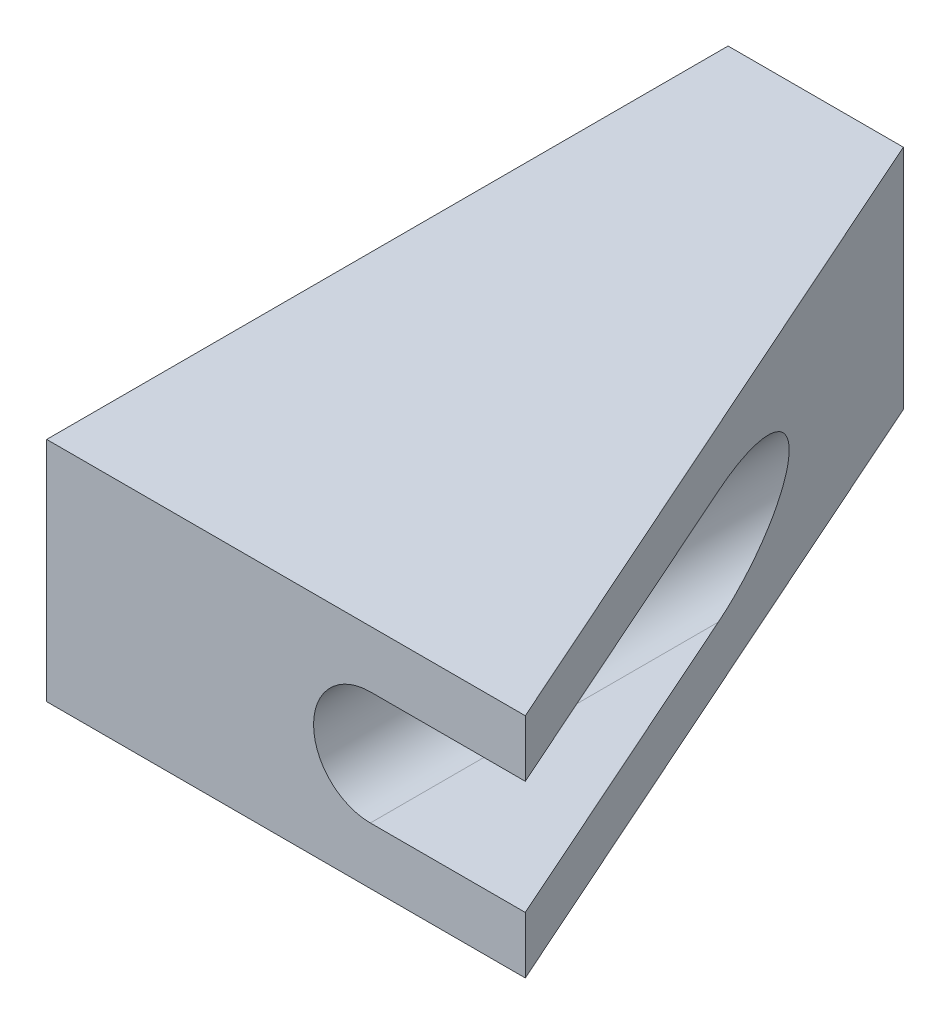
ISO-10303-21;
HEADER;
FILE_DESCRIPTION(('STEP AP214'),'2;1');
FILE_NAME('part.step','',(''),(''),'','','');
FILE_SCHEMA(('AUTOMOTIVE_DESIGN { 1 0 10303 214 1 1 1 1 }'));
ENDSEC;
DATA;
#1=APPLICATION_CONTEXT('core data for automotive mechanical design processes');
#2=APPLICATION_PROTOCOL_DEFINITION('international standard','automotive_design',2000,#1);
#3=PRODUCT_CONTEXT('',#1,'mechanical');
#4=PRODUCT('Part','Part','',(#3));
#5=PRODUCT_RELATED_PRODUCT_CATEGORY('part','',(#4));
#6=PRODUCT_DEFINITION_FORMATION('','',#4);
#7=PRODUCT_DEFINITION_CONTEXT('part definition',#1,'design');
#8=PRODUCT_DEFINITION('design','',#6,#7);
#9=PRODUCT_DEFINITION_SHAPE('','',#8);
#10=(LENGTH_UNIT() NAMED_UNIT(*) SI_UNIT(.MILLI.,.METRE.));
#11=(NAMED_UNIT(*) PLANE_ANGLE_UNIT() SI_UNIT($,.RADIAN.));
#12=(NAMED_UNIT(*) SI_UNIT($,.STERADIAN.) SOLID_ANGLE_UNIT());
#13=UNCERTAINTY_MEASURE_WITH_UNIT(LENGTH_MEASURE(1.E-05),#10,'distance_accuracy_value','');
#14=(GEOMETRIC_REPRESENTATION_CONTEXT(3) GLOBAL_UNCERTAINTY_ASSIGNED_CONTEXT((#13)) GLOBAL_UNIT_ASSIGNED_CONTEXT((#10,
#11,#12)) REPRESENTATION_CONTEXT('',''));
#15=CARTESIAN_POINT('',(0.,0.,0.));
#16=DIRECTION('',(0.,0.,1.));
#17=DIRECTION('',(1.,0.,0.));
#18=AXIS2_PLACEMENT_3D('',#15,#16,#17);
#19=CARTESIAN_POINT('',(8.42869934449654,4.,0.));
#20=DIRECTION('',(0.,0.,-1.));
#21=DIRECTION('',(-1.,0.,0.));
#22=AXIS2_PLACEMENT_3D('',#19,#20,#21);
#23=PLANE('',#22);
#24=DIRECTION('',(1.,0.,0.));
#25=VECTOR('',#24,1.);
#26=CARTESIAN_POINT('',(4.21434967224827,3.,0.));
#27=LINE('',#26,#25);
#28=CARTESIAN_POINT('',(5.7,3.,0.));
#29=VERTEX_POINT('',#28);
#30=CARTESIAN_POINT('',(8.42869934449654,3.,0.));
#31=VERTEX_POINT('',#30);
#32=EDGE_CURVE('E52',#29,#31,#27,.T.);
#33=ORIENTED_EDGE('',*,*,#32,.T.);
#34=DIRECTION('',(0.,-1.,0.));
#35=VECTOR('',#34,1.);
#36=CARTESIAN_POINT('',(8.42869934449654,4.,0.));
#37=LINE('',#36,#35);
#38=CARTESIAN_POINT('',(8.42869934449654,4.,0.));
#39=VERTEX_POINT('',#38);
#40=EDGE_CURVE('E92',#39,#31,#37,.T.);
#41=ORIENTED_EDGE('',*,*,#40,.F.);
#42=DIRECTION('',(1.,0.,0.));
#43=VECTOR('',#42,1.);
#44=CARTESIAN_POINT('',(8.42869934449654,4.,0.));
#45=LINE('',#44,#43);
#46=CARTESIAN_POINT('',(0.,4.,0.));
#47=VERTEX_POINT('',#46);
#48=EDGE_CURVE('E109',#47,#39,#45,.T.);
#49=ORIENTED_EDGE('',*,*,#48,.F.);
#50=DIRECTION('',(0.,-1.,0.));
#51=VECTOR('',#50,1.);
#52=CARTESIAN_POINT('',(0.,4.,0.));
#53=LINE('',#52,#51);
#54=CARTESIAN_POINT('',(0.,0.,0.));
#55=VERTEX_POINT('',#54);
#56=EDGE_CURVE('E119',#47,#55,#53,.T.);
#57=ORIENTED_EDGE('',*,*,#56,.T.);
#58=DIRECTION('',(1.,0.,0.));
#59=VECTOR('',#58,1.);
#60=CARTESIAN_POINT('',(8.42869934449654,0.,0.));
#61=LINE('',#60,#59);
#62=CARTESIAN_POINT('',(8.42869934449654,0.,0.));
#63=VERTEX_POINT('',#62);
#64=EDGE_CURVE('E104',#55,#63,#61,.T.);
#65=ORIENTED_EDGE('',*,*,#64,.T.);
#66=CARTESIAN_POINT('',(8.42869934449654,1.,0.));
#67=VERTEX_POINT('',#66);
#68=EDGE_CURVE('E98',#67,#63,#37,.T.);
#69=ORIENTED_EDGE('',*,*,#68,.F.);
#70=DIRECTION('',(1.,0.,0.));
#71=VECTOR('',#70,1.);
#72=CARTESIAN_POINT('',(4.21434967224827,1.,0.));
#73=LINE('',#72,#71);
#74=CARTESIAN_POINT('',(5.7,1.,0.));
#75=VERTEX_POINT('',#74);
#76=EDGE_CURVE('E87',#75,#67,#73,.T.);
#77=ORIENTED_EDGE('',*,*,#76,.F.);
#78=CARTESIAN_POINT('',(5.7,2.,0.));
#79=DIRECTION('',(0.,0.,1.));
#80=DIRECTION('',(1.,0.,0.));
#81=AXIS2_PLACEMENT_3D('',#78,#79,#80);
#82=CIRCLE('',#81,1.);
#83=EDGE_CURVE('E96',#29,#75,#82,.T.);
#84=ORIENTED_EDGE('',*,*,#83,.F.);
#85=EDGE_LOOP('',(#33,#41,#49,#57,#65,#69,#77,#84));
#86=FACE_BOUND('',#85,.T.);
#87=ADVANCED_FACE('F31',(#86),#23,.F.);
#88=CARTESIAN_POINT('',(3.08595512079419,4.,-12.));
#89=DIRECTION('',(-0.913545457642603,0.,0.406736643075795));
#90=DIRECTION('',(0.406736643075795,0.,0.913545457642603));
#91=AXIS2_PLACEMENT_3D('',#88,#89,#90);
#92=PLANE('',#91);
#93=DIRECTION('',(0.406736643075795,0.,0.913545457642603));
#94=VECTOR('',#93,1.);
#95=CARTESIAN_POINT('',(3.08595512079419,3.,-12.));
#96=LINE('',#95,#94);
#97=CARTESIAN_POINT('',(5.7,3.,-6.12875907266765));
#98=VERTEX_POINT('',#97);
#99=EDGE_CURVE('E102',#98,#31,#96,.T.);
#100=ORIENTED_EDGE('',*,*,#99,.F.);
#101=CARTESIAN_POINT('',(5.7,2.,-6.12875907266765));
#102=DIRECTION('',(-0.913545457642603,0.,0.406736643075795));
#103=DIRECTION('',(0.406736643075795,0.,0.913545457642603));
#104=AXIS2_PLACEMENT_3D('',#101,#102,#103);
#105=ELLIPSE('',#104,2.45859333557427,1.);
#106=CARTESIAN_POINT('',(5.7,1.,-6.12875907266765));
#107=VERTEX_POINT('',#106);
#108=EDGE_CURVE('E101',#98,#107,#105,.T.);
#109=ORIENTED_EDGE('',*,*,#108,.T.);
#110=DIRECTION('',(0.406736643075795,0.,0.913545457642603));
#111=VECTOR('',#110,1.);
#112=CARTESIAN_POINT('',(3.08595512079419,1.,-12.));
#113=LINE('',#112,#111);
#114=EDGE_CURVE('E45',#107,#67,#113,.T.);
#115=ORIENTED_EDGE('',*,*,#114,.T.);
#116=ORIENTED_EDGE('',*,*,#68,.T.);
#117=DIRECTION('',(-0.406736643075795,0.,-0.913545457642603));
#118=VECTOR('',#117,1.);
#119=CARTESIAN_POINT('',(3.08595512079419,0.,-12.));
#120=LINE('',#119,#118);
#121=CARTESIAN_POINT('',(3.08595512079419,0.,-12.));
#122=VERTEX_POINT('',#121);
#123=EDGE_CURVE('E121',#63,#122,#120,.T.);
#124=ORIENTED_EDGE('',*,*,#123,.T.);
#125=DIRECTION('',(0.,-1.,0.));
#126=VECTOR('',#125,1.);
#127=CARTESIAN_POINT('',(3.08595512079419,4.,-12.));
#128=LINE('',#127,#126);
#129=CARTESIAN_POINT('',(3.08595512079419,4.,-12.));
#130=VERTEX_POINT('',#129);
#131=EDGE_CURVE('E131',#130,#122,#128,.T.);
#132=ORIENTED_EDGE('',*,*,#131,.F.);
#133=DIRECTION('',(-0.406736643075795,0.,-0.913545457642603));
#134=VECTOR('',#133,1.);
#135=CARTESIAN_POINT('',(3.08595512079419,4.,-12.));
#136=LINE('',#135,#134);
#137=EDGE_CURVE('E112',#39,#130,#136,.T.);
#138=ORIENTED_EDGE('',*,*,#137,.F.);
#139=ORIENTED_EDGE('',*,*,#40,.T.);
#140=EDGE_LOOP('',(#100,#109,#115,#116,#124,#132,#138,#139));
#141=FACE_BOUND('',#140,.T.);
#142=ADVANCED_FACE('F139',(#141),#92,.F.);
#143=CARTESIAN_POINT('',(5.7,2.,-12.));
#144=DIRECTION('',(0.,0.,1.));
#145=DIRECTION('',(1.,0.,0.));
#146=AXIS2_PLACEMENT_3D('',#143,#144,#145);
#147=CYLINDRICAL_SURFACE('',#146,1.);
#148=DIRECTION('',(0.,0.,1.));
#149=VECTOR('',#148,1.);
#150=CARTESIAN_POINT('',(5.7,3.,-12.));
#151=LINE('',#150,#149);
#152=EDGE_CURVE('E11',#29,#98,#151,.F.);
#153=ORIENTED_EDGE('',*,*,#152,.F.);
#154=ORIENTED_EDGE('',*,*,#83,.T.);
#155=DIRECTION('',(0.,0.,1.));
#156=VECTOR('',#155,1.);
#157=CARTESIAN_POINT('',(5.7,1.,-12.));
#158=LINE('',#157,#156);
#159=EDGE_CURVE('E38',#75,#107,#158,.F.);
#160=ORIENTED_EDGE('',*,*,#159,.T.);
#161=ORIENTED_EDGE('',*,*,#108,.F.);
#162=EDGE_LOOP('',(#153,#154,#160,#161));
#163=FACE_BOUND('',#162,.T.);
#164=ADVANCED_FACE('F100',(#163),#147,.F.);
#165=CARTESIAN_POINT('',(0.,4.,-12.));
#166=DIRECTION('',(0.,0.,1.));
#167=DIRECTION('',(1.,0.,0.));
#168=AXIS2_PLACEMENT_3D('',#165,#166,#167);
#169=PLANE('',#168);
#170=DIRECTION('',(-1.,0.,0.));
#171=VECTOR('',#170,1.);
#172=CARTESIAN_POINT('',(0.,0.,-12.));
#173=LINE('',#172,#171);
#174=CARTESIAN_POINT('',(0.,0.,-12.));
#175=VERTEX_POINT('',#174);
#176=EDGE_CURVE('E123',#122,#175,#173,.T.);
#177=ORIENTED_EDGE('',*,*,#176,.T.);
#178=DIRECTION('',(0.,-1.,0.));
#179=VECTOR('',#178,1.);
#180=CARTESIAN_POINT('',(0.,4.,-12.));
#181=LINE('',#180,#179);
#182=CARTESIAN_POINT('',(0.,4.,-12.));
#183=VERTEX_POINT('',#182);
#184=EDGE_CURVE('E128',#183,#175,#181,.T.);
#185=ORIENTED_EDGE('',*,*,#184,.F.);
#186=DIRECTION('',(-1.,0.,0.));
#187=VECTOR('',#186,1.);
#188=CARTESIAN_POINT('',(0.,4.,-12.));
#189=LINE('',#188,#187);
#190=EDGE_CURVE('E115',#130,#183,#189,.T.);
#191=ORIENTED_EDGE('',*,*,#190,.F.);
#192=ORIENTED_EDGE('',*,*,#131,.T.);
#193=EDGE_LOOP('',(#177,#185,#191,#192));
#194=FACE_BOUND('',#193,.T.);
#195=ADVANCED_FACE('F154',(#194),#169,.F.);
#196=CARTESIAN_POINT('',(0.,4.,0.));
#197=DIRECTION('',(1.,0.,0.));
#198=DIRECTION('',(0.,0.,-1.));
#199=AXIS2_PLACEMENT_3D('',#196,#197,#198);
#200=PLANE('',#199);
#201=DIRECTION('',(0.,0.,1.));
#202=VECTOR('',#201,1.);
#203=CARTESIAN_POINT('',(0.,0.,0.));
#204=LINE('',#203,#202);
#205=EDGE_CURVE('E113',#175,#55,#204,.T.);
#206=ORIENTED_EDGE('',*,*,#205,.T.);
#207=ORIENTED_EDGE('',*,*,#56,.F.);
#208=DIRECTION('',(0.,0.,1.));
#209=VECTOR('',#208,1.);
#210=CARTESIAN_POINT('',(0.,4.,0.));
#211=LINE('',#210,#209);
#212=EDGE_CURVE('E117',#183,#47,#211,.T.);
#213=ORIENTED_EDGE('',*,*,#212,.F.);
#214=ORIENTED_EDGE('',*,*,#184,.T.);
#215=EDGE_LOOP('',(#206,#207,#213,#214));
#216=FACE_BOUND('',#215,.T.);
#217=ADVANCED_FACE('F150',(#216),#200,.F.);
#218=CARTESIAN_POINT('',(0.,4.,0.));
#219=DIRECTION('',(0.,-1.,0.));
#220=DIRECTION('',(0.,0.,-1.));
#221=AXIS2_PLACEMENT_3D('',#218,#219,#220);
#222=PLANE('',#221);
#223=ORIENTED_EDGE('',*,*,#48,.T.);
#224=ORIENTED_EDGE('',*,*,#137,.T.);
#225=ORIENTED_EDGE('',*,*,#190,.T.);
#226=ORIENTED_EDGE('',*,*,#212,.T.);
#227=EDGE_LOOP('',(#223,#224,#225,#226));
#228=FACE_BOUND('',#227,.T.);
#229=ADVANCED_FACE('F156',(#228),#222,.F.);
#230=CARTESIAN_POINT('',(0.,0.,0.));
#231=DIRECTION('',(0.,-1.,0.));
#232=DIRECTION('',(0.,0.,-1.));
#233=AXIS2_PLACEMENT_3D('',#230,#231,#232);
#234=PLANE('',#233);
#235=ORIENTED_EDGE('',*,*,#64,.F.);
#236=ORIENTED_EDGE('',*,*,#205,.F.);
#237=ORIENTED_EDGE('',*,*,#176,.F.);
#238=ORIENTED_EDGE('',*,*,#123,.F.);
#239=EDGE_LOOP('',(#235,#236,#237,#238));
#240=FACE_BOUND('',#239,.T.);
#241=ADVANCED_FACE('F144',(#240),#234,.T.);
#242=CARTESIAN_POINT('',(4.21434967224827,1.,-12.));
#243=DIRECTION('',(0.,-1.,0.));
#244=DIRECTION('',(0.,0.,-1.));
#245=AXIS2_PLACEMENT_3D('',#242,#243,#244);
#246=PLANE('',#245);
#247=ORIENTED_EDGE('',*,*,#159,.F.);
#248=ORIENTED_EDGE('',*,*,#76,.T.);
#249=ORIENTED_EDGE('',*,*,#114,.F.);
#250=EDGE_LOOP('',(#247,#248,#249));
#251=FACE_BOUND('',#250,.T.);
#252=ADVANCED_FACE('F86',(#251),#246,.F.);
#253=CARTESIAN_POINT('',(4.21434967224827,3.,-12.));
#254=DIRECTION('',(0.,-1.,0.));
#255=DIRECTION('',(0.,0.,-1.));
#256=AXIS2_PLACEMENT_3D('',#253,#254,#255);
#257=PLANE('',#256);
#258=ORIENTED_EDGE('',*,*,#99,.T.);
#259=ORIENTED_EDGE('',*,*,#32,.F.);
#260=ORIENTED_EDGE('',*,*,#152,.T.);
#261=EDGE_LOOP('',(#258,#259,#260));
#262=FACE_BOUND('',#261,.T.);
#263=ADVANCED_FACE('F215',(#262),#257,.T.);
#264=CLOSED_SHELL('',(#87,#142,#164,#195,#217,#229,#241,#252,#263));
#265=MANIFOLD_SOLID_BREP('B2',#264);
#266=ADVANCED_BREP_SHAPE_REPRESENTATION('',(#18,#265),#14);
#267=SHAPE_DEFINITION_REPRESENTATION(#9,#266);
ENDSEC;
END-ISO-10303-21;
